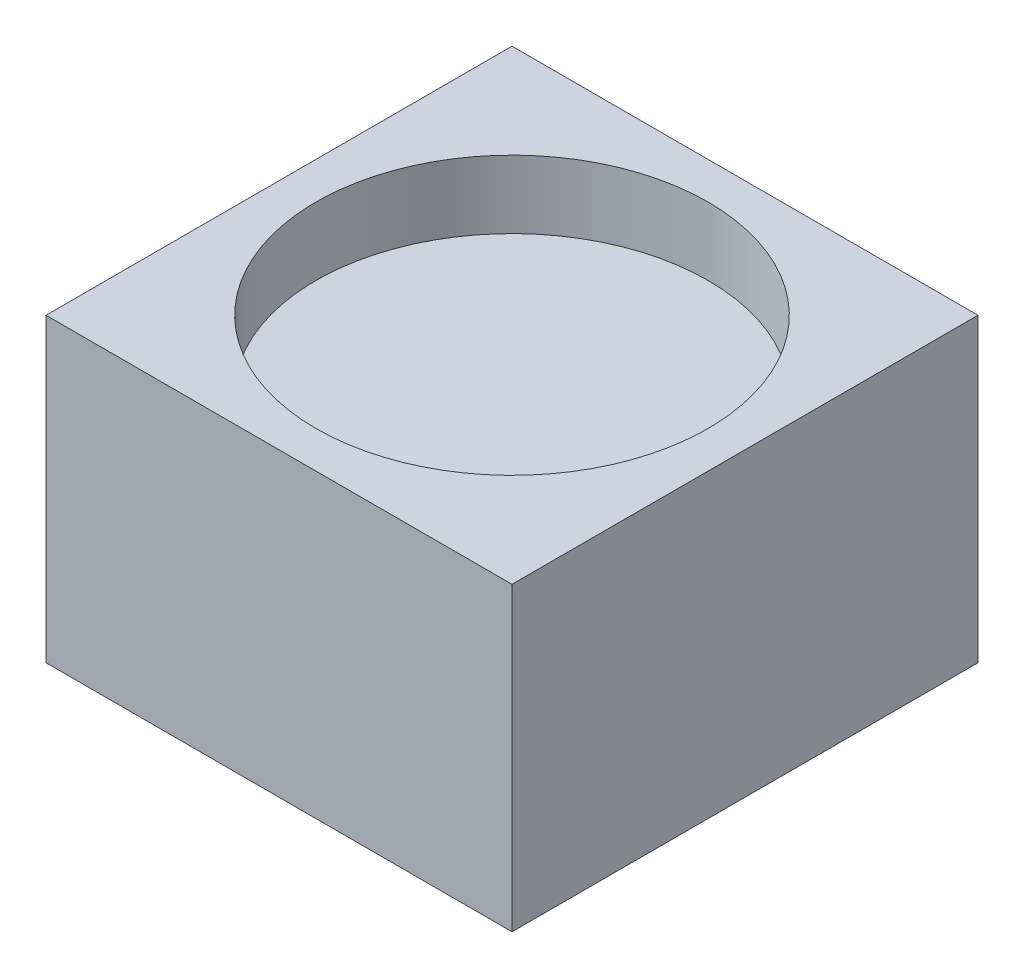
ISO-10303-21;
HEADER;
FILE_DESCRIPTION(('STEP AP214'),'2;1');
FILE_NAME('part.step','',(''),(''),'','','');
FILE_SCHEMA(('AUTOMOTIVE_DESIGN { 1 0 10303 214 1 1 1 1 }'));
ENDSEC;
DATA;
#1=APPLICATION_CONTEXT('core data for automotive mechanical design processes');
#2=APPLICATION_PROTOCOL_DEFINITION('international standard','automotive_design',2000,#1);
#3=PRODUCT_CONTEXT('',#1,'mechanical');
#4=PRODUCT('Part','Part','',(#3));
#5=PRODUCT_RELATED_PRODUCT_CATEGORY('part','',(#4));
#6=PRODUCT_DEFINITION_FORMATION('','',#4);
#7=PRODUCT_DEFINITION_CONTEXT('part definition',#1,'design');
#8=PRODUCT_DEFINITION('design','',#6,#7);
#9=PRODUCT_DEFINITION_SHAPE('','',#8);
#10=(LENGTH_UNIT() NAMED_UNIT(*) SI_UNIT(.MILLI.,.METRE.));
#11=(NAMED_UNIT(*) PLANE_ANGLE_UNIT() SI_UNIT($,.RADIAN.));
#12=(NAMED_UNIT(*) SI_UNIT($,.STERADIAN.) SOLID_ANGLE_UNIT());
#13=UNCERTAINTY_MEASURE_WITH_UNIT(LENGTH_MEASURE(1.E-05),#10,'distance_accuracy_value','');
#14=(GEOMETRIC_REPRESENTATION_CONTEXT(3) GLOBAL_UNCERTAINTY_ASSIGNED_CONTEXT((#13)) GLOBAL_UNIT_ASSIGNED_CONTEXT((#10,
#11,#12)) REPRESENTATION_CONTEXT('',''));
#15=CARTESIAN_POINT('',(0.,0.,0.));
#16=DIRECTION('',(0.,0.,1.));
#17=DIRECTION('',(1.,0.,0.));
#18=AXIS2_PLACEMENT_3D('',#15,#16,#17);
#19=CARTESIAN_POINT('',(0.,22.225,0.));
#20=DIRECTION('',(0.,-1.,0.));
#21=DIRECTION('',(0.,0.,-1.));
#22=AXIS2_PLACEMENT_3D('',#19,#20,#21);
#23=PLANE('',#22);
#24=DIRECTION('',(0.,0.,-1.));
#25=VECTOR('',#24,1.);
#26=CARTESIAN_POINT('',(76.2,22.225,76.2));
#27=LINE('',#26,#25);
#28=CARTESIAN_POINT('',(76.2,22.225,76.2));
#29=VERTEX_POINT('',#28);
#30=CARTESIAN_POINT('',(76.2,22.225,-76.2));
#31=VERTEX_POINT('',#30);
#32=EDGE_CURVE('E113',#29,#31,#27,.T.);
#33=ORIENTED_EDGE('',*,*,#32,.T.);
#34=DIRECTION('',(-1.,0.,0.));
#35=VECTOR('',#34,1.);
#36=CARTESIAN_POINT('',(-76.2,22.225,-76.2));
#37=LINE('',#36,#35);
#38=CARTESIAN_POINT('',(-76.2,22.225,-76.2));
#39=VERTEX_POINT('',#38);
#40=EDGE_CURVE('E119',#31,#39,#37,.T.);
#41=ORIENTED_EDGE('',*,*,#40,.T.);
#42=DIRECTION('',(0.,0.,1.));
#43=VECTOR('',#42,1.);
#44=CARTESIAN_POINT('',(-76.2,22.225,76.2));
#45=LINE('',#44,#43);
#46=CARTESIAN_POINT('',(-76.2,22.225,76.2));
#47=VERTEX_POINT('',#46);
#48=EDGE_CURVE('E60',#39,#47,#45,.T.);
#49=ORIENTED_EDGE('',*,*,#48,.T.);
#50=DIRECTION('',(1.,0.,0.));
#51=VECTOR('',#50,1.);
#52=CARTESIAN_POINT('',(-76.2,22.225,76.2));
#53=LINE('',#52,#51);
#54=EDGE_CURVE('E55',#47,#29,#53,.T.);
#55=ORIENTED_EDGE('',*,*,#54,.T.);
#56=EDGE_LOOP('',(#33,#41,#49,#55));
#57=FACE_BOUND('',#56,.T.);
#58=CARTESIAN_POINT('',(0.,22.225,0.));
#59=DIRECTION('',(0.,1.,0.));
#60=DIRECTION('',(0.,0.,1.));
#61=AXIS2_PLACEMENT_3D('',#58,#59,#60);
#62=CIRCLE('',#61,64.135);
#63=CARTESIAN_POINT('',(0.,22.225,64.135));
#64=VERTEX_POINT('',#63);
#65=EDGE_CURVE('E109',#64,#64,#62,.T.);
#66=ORIENTED_EDGE('',*,*,#65,.F.);
#67=EDGE_LOOP('',(#66));
#68=FACE_BOUND('',#67,.T.);
#69=ADVANCED_FACE('F39',(#57,#68),#23,.F.);
#70=CARTESIAN_POINT('',(76.2,22.225,76.2));
#71=DIRECTION('',(-1.,0.,0.));
#72=DIRECTION('',(0.,0.,1.));
#73=AXIS2_PLACEMENT_3D('',#70,#71,#72);
#74=PLANE('',#73);
#75=DIRECTION('',(0.,-1.,0.));
#76=VECTOR('',#75,1.);
#77=CARTESIAN_POINT('',(76.2,22.225,76.2));
#78=LINE('',#77,#76);
#79=CARTESIAN_POINT('',(76.2,-76.2,76.2));
#80=VERTEX_POINT('',#79);
#81=EDGE_CURVE('E126',#29,#80,#78,.T.);
#82=ORIENTED_EDGE('',*,*,#81,.T.);
#83=DIRECTION('',(0.,0.,1.));
#84=VECTOR('',#83,1.);
#85=CARTESIAN_POINT('',(76.2,-76.2,76.2));
#86=LINE('',#85,#84);
#87=CARTESIAN_POINT('',(76.2,-76.2,-76.2));
#88=VERTEX_POINT('',#87);
#89=EDGE_CURVE('E95',#88,#80,#86,.T.);
#90=ORIENTED_EDGE('',*,*,#89,.F.);
#91=DIRECTION('',(0.,-1.,0.));
#92=VECTOR('',#91,1.);
#93=CARTESIAN_POINT('',(76.2,22.225,-76.2));
#94=LINE('',#93,#92);
#95=EDGE_CURVE('E11',#31,#88,#94,.T.);
#96=ORIENTED_EDGE('',*,*,#95,.F.);
#97=ORIENTED_EDGE('',*,*,#32,.F.);
#98=EDGE_LOOP('',(#82,#90,#96,#97));
#99=FACE_BOUND('',#98,.T.);
#100=ADVANCED_FACE('F41',(#99),#74,.F.);
#101=CARTESIAN_POINT('',(-76.2,22.225,-76.2));
#102=DIRECTION('',(0.,0.,1.));
#103=DIRECTION('',(1.,0.,0.));
#104=AXIS2_PLACEMENT_3D('',#101,#102,#103);
#105=PLANE('',#104);
#106=ORIENTED_EDGE('',*,*,#95,.T.);
#107=DIRECTION('',(1.,0.,0.));
#108=VECTOR('',#107,1.);
#109=CARTESIAN_POINT('',(-76.2,-76.2,-76.2));
#110=LINE('',#109,#108);
#111=CARTESIAN_POINT('',(-76.2,-76.2,-76.2));
#112=VERTEX_POINT('',#111);
#113=EDGE_CURVE('E88',#112,#88,#110,.T.);
#114=ORIENTED_EDGE('',*,*,#113,.F.);
#115=DIRECTION('',(0.,-1.,0.));
#116=VECTOR('',#115,1.);
#117=CARTESIAN_POINT('',(-76.2,22.225,-76.2));
#118=LINE('',#117,#116);
#119=EDGE_CURVE('E48',#39,#112,#118,.T.);
#120=ORIENTED_EDGE('',*,*,#119,.F.);
#121=ORIENTED_EDGE('',*,*,#40,.F.);
#122=EDGE_LOOP('',(#106,#114,#120,#121));
#123=FACE_BOUND('',#122,.T.);
#124=ADVANCED_FACE('F89',(#123),#105,.F.);
#125=CARTESIAN_POINT('',(-76.2,22.225,76.2));
#126=DIRECTION('',(1.,0.,0.));
#127=DIRECTION('',(0.,0.,-1.));
#128=AXIS2_PLACEMENT_3D('',#125,#126,#127);
#129=PLANE('',#128);
#130=ORIENTED_EDGE('',*,*,#119,.T.);
#131=DIRECTION('',(0.,0.,-1.));
#132=VECTOR('',#131,1.);
#133=CARTESIAN_POINT('',(-76.2,-76.2,76.2));
#134=LINE('',#133,#132);
#135=CARTESIAN_POINT('',(-76.2,-76.2,76.2));
#136=VERTEX_POINT('',#135);
#137=EDGE_CURVE('E83',#136,#112,#134,.T.);
#138=ORIENTED_EDGE('',*,*,#137,.F.);
#139=DIRECTION('',(0.,-1.,0.));
#140=VECTOR('',#139,1.);
#141=CARTESIAN_POINT('',(-76.2,22.225,76.2));
#142=LINE('',#141,#140);
#143=EDGE_CURVE('E86',#47,#136,#142,.T.);
#144=ORIENTED_EDGE('',*,*,#143,.F.);
#145=ORIENTED_EDGE('',*,*,#48,.F.);
#146=EDGE_LOOP('',(#130,#138,#144,#145));
#147=FACE_BOUND('',#146,.T.);
#148=ADVANCED_FACE('F81',(#147),#129,.F.);
#149=CARTESIAN_POINT('',(-76.2,22.225,76.2));
#150=DIRECTION('',(0.,0.,-1.));
#151=DIRECTION('',(-1.,0.,0.));
#152=AXIS2_PLACEMENT_3D('',#149,#150,#151);
#153=PLANE('',#152);
#154=ORIENTED_EDGE('',*,*,#143,.T.);
#155=DIRECTION('',(-1.,0.,0.));
#156=VECTOR('',#155,1.);
#157=CARTESIAN_POINT('',(-76.2,-76.2,76.2));
#158=LINE('',#157,#156);
#159=EDGE_CURVE('E100',#80,#136,#158,.T.);
#160=ORIENTED_EDGE('',*,*,#159,.F.);
#161=ORIENTED_EDGE('',*,*,#81,.F.);
#162=ORIENTED_EDGE('',*,*,#54,.F.);
#163=EDGE_LOOP('',(#154,#160,#161,#162));
#164=FACE_BOUND('',#163,.T.);
#165=ADVANCED_FACE('F131',(#164),#153,.F.);
#166=CARTESIAN_POINT('',(0.,22.225,0.));
#167=DIRECTION('',(0.,-1.,0.));
#168=DIRECTION('',(0.,0.,-1.));
#169=AXIS2_PLACEMENT_3D('',#166,#167,#168);
#170=CYLINDRICAL_SURFACE('',#169,64.135);
#171=ORIENTED_EDGE('',*,*,#65,.T.);
#172=EDGE_LOOP('',(#171));
#173=FACE_BOUND('',#172,.T.);
#174=CARTESIAN_POINT('',(0.,0.,0.));
#175=DIRECTION('',(0.,1.,0.));
#176=DIRECTION('',(0.,0.,1.));
#177=AXIS2_PLACEMENT_3D('',#174,#175,#176);
#178=CIRCLE('',#177,64.135);
#179=CARTESIAN_POINT('',(0.,0.,64.135));
#180=VERTEX_POINT('',#179);
#181=EDGE_CURVE('E108',#180,#180,#178,.T.);
#182=ORIENTED_EDGE('',*,*,#181,.F.);
#183=EDGE_LOOP('',(#182));
#184=FACE_BOUND('',#183,.T.);
#185=ADVANCED_FACE('F139',(#173,#184),#170,.F.);
#186=CARTESIAN_POINT('',(0.,0.,0.));
#187=DIRECTION('',(0.,-1.,0.));
#188=DIRECTION('',(0.,0.,-1.));
#189=AXIS2_PLACEMENT_3D('',#186,#187,#188);
#190=PLANE('',#189);
#191=ORIENTED_EDGE('',*,*,#181,.T.);
#192=EDGE_LOOP('',(#191));
#193=FACE_BOUND('',#192,.T.);
#194=ADVANCED_FACE('F142',(#193),#190,.F.);
#195=CARTESIAN_POINT('',(0.,-76.2,0.));
#196=DIRECTION('',(0.,-1.,0.));
#197=DIRECTION('',(0.,0.,-1.));
#198=AXIS2_PLACEMENT_3D('',#195,#196,#197);
#199=PLANE('',#198);
#200=ORIENTED_EDGE('',*,*,#137,.T.);
#201=ORIENTED_EDGE('',*,*,#113,.T.);
#202=ORIENTED_EDGE('',*,*,#89,.T.);
#203=ORIENTED_EDGE('',*,*,#159,.T.);
#204=EDGE_LOOP('',(#200,#201,#202,#203));
#205=FACE_BOUND('',#204,.T.);
#206=ADVANCED_FACE('F98',(#205),#199,.T.);
#207=CLOSED_SHELL('',(#69,#100,#124,#148,#165,#185,#194,#206));
#208=MANIFOLD_SOLID_BREP('B2',#207);
#209=ADVANCED_BREP_SHAPE_REPRESENTATION('',(#18,#208),#14);
#210=SHAPE_DEFINITION_REPRESENTATION(#9,#209);
ENDSEC;
END-ISO-10303-21;
